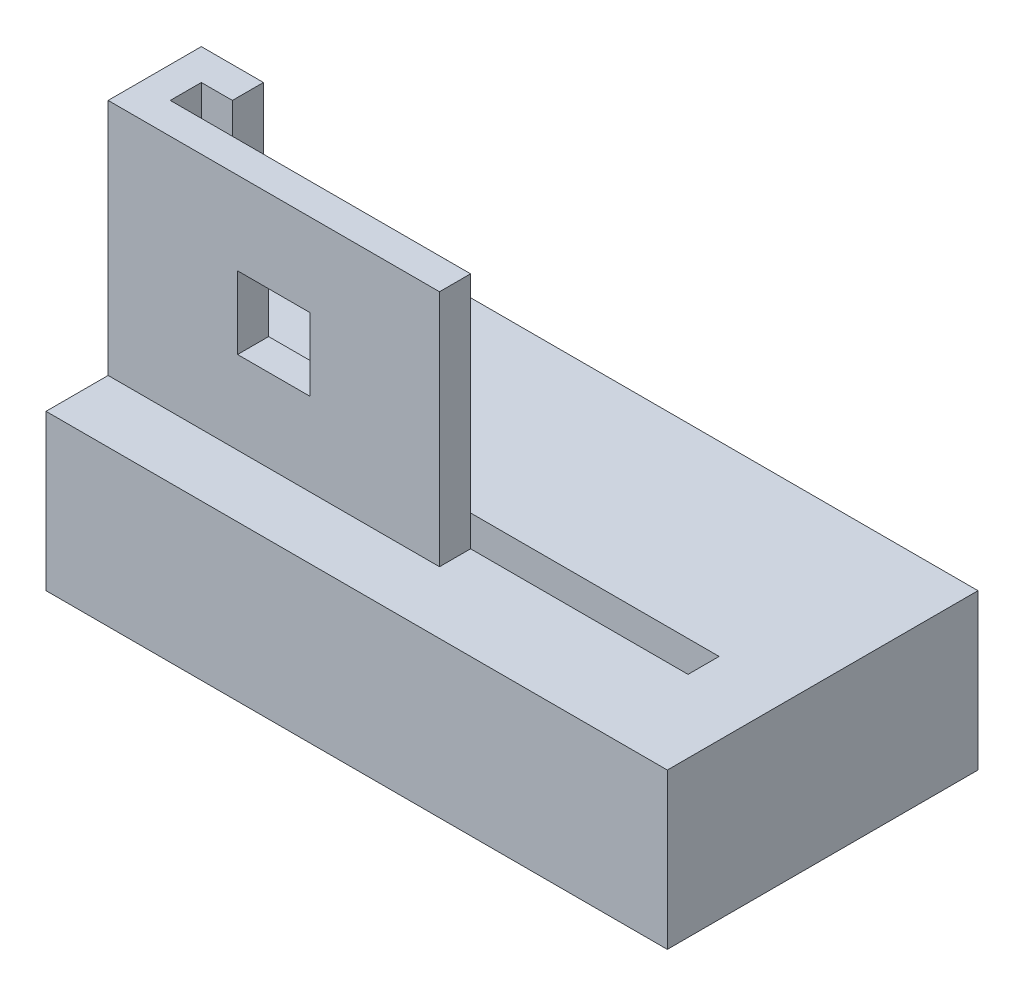
ISO-10303-21;
HEADER;
FILE_DESCRIPTION(('STEP AP214'),'2;1');
FILE_NAME('part.step','',(''),(''),'','','');
FILE_SCHEMA(('AUTOMOTIVE_DESIGN { 1 0 10303 214 1 1 1 1 }'));
ENDSEC;
DATA;
#1=APPLICATION_CONTEXT('core data for automotive mechanical design processes');
#2=APPLICATION_PROTOCOL_DEFINITION('international standard','automotive_design',2000,#1);
#3=PRODUCT_CONTEXT('',#1,'mechanical');
#4=PRODUCT('Part','Part','',(#3));
#5=PRODUCT_RELATED_PRODUCT_CATEGORY('part','',(#4));
#6=PRODUCT_DEFINITION_FORMATION('','',#4);
#7=PRODUCT_DEFINITION_CONTEXT('part definition',#1,'design');
#8=PRODUCT_DEFINITION('design','',#6,#7);
#9=PRODUCT_DEFINITION_SHAPE('','',#8);
#10=(LENGTH_UNIT() NAMED_UNIT(*) SI_UNIT(.MILLI.,.METRE.));
#11=(NAMED_UNIT(*) PLANE_ANGLE_UNIT() SI_UNIT($,.RADIAN.));
#12=(NAMED_UNIT(*) SI_UNIT($,.STERADIAN.) SOLID_ANGLE_UNIT());
#13=UNCERTAINTY_MEASURE_WITH_UNIT(LENGTH_MEASURE(1.E-05),#10,'distance_accuracy_value','');
#14=(GEOMETRIC_REPRESENTATION_CONTEXT(3) GLOBAL_UNCERTAINTY_ASSIGNED_CONTEXT((#13)) GLOBAL_UNIT_ASSIGNED_CONTEXT((#10,
#11,#12)) REPRESENTATION_CONTEXT('',''));
#15=CARTESIAN_POINT('',(0.,0.,0.));
#16=DIRECTION('',(0.,0.,1.));
#17=DIRECTION('',(1.,0.,0.));
#18=AXIS2_PLACEMENT_3D('',#15,#16,#17);
#19=CARTESIAN_POINT('',(0.,15.,0.));
#20=DIRECTION('',(0.,-1.,0.));
#21=DIRECTION('',(0.,0.,-1.));
#22=AXIS2_PLACEMENT_3D('',#19,#20,#21);
#23=PLANE('',#22);
#24=DIRECTION('',(0.,0.,-1.));
#25=VECTOR('',#24,1.);
#26=CARTESIAN_POINT('',(-54.,15.,15.));
#27=LINE('',#26,#25);
#28=CARTESIAN_POINT('',(-54.,15.,18.));
#29=VERTEX_POINT('',#28);
#30=CARTESIAN_POINT('',(-54.,15.,15.));
#31=VERTEX_POINT('',#30);
#32=EDGE_CURVE('E236',#29,#31,#27,.T.);
#33=ORIENTED_EDGE('',*,*,#32,.F.);
#34=DIRECTION('',(-1.,0.,0.));
#35=VECTOR('',#34,1.);
#36=CARTESIAN_POINT('',(-57.,15.,18.));
#37=LINE('',#36,#35);
#38=CARTESIAN_POINT('',(-6.99999999999999,15.,18.));
#39=VERTEX_POINT('',#38);
#40=EDGE_CURVE('E194',#39,#29,#37,.T.);
#41=ORIENTED_EDGE('',*,*,#40,.F.);
#42=DIRECTION('',(0.,0.,-1.));
#43=VECTOR('',#42,1.);
#44=CARTESIAN_POINT('',(-6.99999999999999,15.,18.));
#45=LINE('',#44,#43);
#46=CARTESIAN_POINT('',(-6.99999999999999,15.,21.));
#47=VERTEX_POINT('',#46);
#48=EDGE_CURVE('E205',#47,#39,#45,.T.);
#49=ORIENTED_EDGE('',*,*,#48,.F.);
#50=DIRECTION('',(1.,0.,0.));
#51=VECTOR('',#50,1.);
#52=CARTESIAN_POINT('',(-57.,15.,21.));
#53=LINE('',#52,#51);
#54=CARTESIAN_POINT('',(-28.,15.,21.));
#55=VERTEX_POINT('',#54);
#56=EDGE_CURVE('E187',#55,#47,#53,.T.);
#57=ORIENTED_EDGE('',*,*,#56,.F.);
#58=DIRECTION('',(0.,0.,-1.));
#59=VECTOR('',#58,1.);
#60=CARTESIAN_POINT('',(-28.,15.,21.));
#61=LINE('',#60,#59);
#62=CARTESIAN_POINT('',(-28.,15.,24.));
#63=VERTEX_POINT('',#62);
#64=EDGE_CURVE('E233',#63,#55,#61,.T.);
#65=ORIENTED_EDGE('',*,*,#64,.F.);
#66=DIRECTION('',(1.,0.,0.));
#67=VECTOR('',#66,1.);
#68=CARTESIAN_POINT('',(-28.,15.,24.));
#69=LINE('',#68,#67);
#70=CARTESIAN_POINT('',(-60.,15.,24.));
#71=VERTEX_POINT('',#70);
#72=EDGE_CURVE('E211',#71,#63,#69,.T.);
#73=ORIENTED_EDGE('',*,*,#72,.F.);
#74=DIRECTION('',(0.,0.,1.));
#75=VECTOR('',#74,1.);
#76=CARTESIAN_POINT('',(-60.,15.,0.));
#77=LINE('',#76,#75);
#78=CARTESIAN_POINT('',(-60.,15.,30.));
#79=VERTEX_POINT('',#78);
#80=EDGE_CURVE('E346',#71,#79,#77,.T.);
#81=ORIENTED_EDGE('',*,*,#80,.T.);
#82=DIRECTION('',(-1.,0.,0.));
#83=VECTOR('',#82,1.);
#84=CARTESIAN_POINT('',(0.,15.,30.));
#85=LINE('',#84,#83);
#86=CARTESIAN_POINT('',(0.,15.,30.));
#87=VERTEX_POINT('',#86);
#88=EDGE_CURVE('E350',#87,#79,#85,.T.);
#89=ORIENTED_EDGE('',*,*,#88,.F.);
#90=DIRECTION('',(0.,0.,1.));
#91=VECTOR('',#90,1.);
#92=CARTESIAN_POINT('',(0.,15.,0.));
#93=LINE('',#92,#91);
#94=CARTESIAN_POINT('',(0.,15.,0.));
#95=VERTEX_POINT('',#94);
#96=EDGE_CURVE('E337',#95,#87,#93,.T.);
#97=ORIENTED_EDGE('',*,*,#96,.F.);
#98=DIRECTION('',(-1.,0.,0.));
#99=VECTOR('',#98,1.);
#100=CARTESIAN_POINT('',(0.,15.,0.));
#101=LINE('',#100,#99);
#102=CARTESIAN_POINT('',(-60.,15.,0.));
#103=VERTEX_POINT('',#102);
#104=EDGE_CURVE('E331',#95,#103,#101,.T.);
#105=ORIENTED_EDGE('',*,*,#104,.T.);
#106=CARTESIAN_POINT('',(-60.,15.,15.));
#107=VERTEX_POINT('',#106);
#108=EDGE_CURVE('E344',#103,#107,#77,.T.);
#109=ORIENTED_EDGE('',*,*,#108,.T.);
#110=DIRECTION('',(-1.,0.,0.));
#111=VECTOR('',#110,1.);
#112=CARTESIAN_POINT('',(-60.,15.,15.));
#113=LINE('',#112,#111);
#114=EDGE_CURVE('E218',#31,#107,#113,.T.);
#115=ORIENTED_EDGE('',*,*,#114,.F.);
#116=EDGE_LOOP('',(#33,#41,#49,#57,#65,#73,#81,#89,#97,#105,#109,#115));
#117=FACE_BOUND('',#116,.T.);
#118=ADVANCED_FACE('F33',(#117),#23,.F.);
#119=CARTESIAN_POINT('',(0.,0.,0.));
#120=DIRECTION('',(0.,-1.,0.));
#121=DIRECTION('',(0.,0.,-1.));
#122=AXIS2_PLACEMENT_3D('',#119,#120,#121);
#123=PLANE('',#122);
#124=DIRECTION('',(0.,0.,1.));
#125=VECTOR('',#124,1.);
#126=CARTESIAN_POINT('',(-60.,0.,0.));
#127=LINE('',#126,#125);
#128=CARTESIAN_POINT('',(-60.,0.,15.));
#129=VERTEX_POINT('',#128);
#130=CARTESIAN_POINT('',(-60.,0.,30.));
#131=VERTEX_POINT('',#130);
#132=EDGE_CURVE('E316',#129,#131,#127,.T.);
#133=ORIENTED_EDGE('',*,*,#132,.F.);
#134=CARTESIAN_POINT('',(-55.,0.,15.));
#135=DIRECTION('',(0.,-1.,0.));
#136=DIRECTION('',(0.,0.,-1.));
#137=AXIS2_PLACEMENT_3D('',#134,#135,#136);
#138=CIRCLE('',#137,5.);
#139=EDGE_CURVE('E328',#129,#129,#138,.T.);
#140=ORIENTED_EDGE('',*,*,#139,.F.);
#141=CARTESIAN_POINT('',(-60.,0.,0.));
#142=VERTEX_POINT('',#141);
#143=EDGE_CURVE('E334',#142,#129,#127,.T.);
#144=ORIENTED_EDGE('',*,*,#143,.F.);
#145=DIRECTION('',(-1.,0.,0.));
#146=VECTOR('',#145,1.);
#147=CARTESIAN_POINT('',(0.,0.,0.));
#148=LINE('',#147,#146);
#149=CARTESIAN_POINT('',(0.,0.,0.));
#150=VERTEX_POINT('',#149);
#151=EDGE_CURVE('E323',#150,#142,#148,.T.);
#152=ORIENTED_EDGE('',*,*,#151,.F.);
#153=DIRECTION('',(0.,0.,1.));
#154=VECTOR('',#153,1.);
#155=CARTESIAN_POINT('',(0.,0.,0.));
#156=LINE('',#155,#154);
#157=CARTESIAN_POINT('',(0.,0.,30.));
#158=VERTEX_POINT('',#157);
#159=EDGE_CURVE('E317',#150,#158,#156,.T.);
#160=ORIENTED_EDGE('',*,*,#159,.T.);
#161=DIRECTION('',(-1.,0.,0.));
#162=VECTOR('',#161,1.);
#163=CARTESIAN_POINT('',(0.,0.,30.));
#164=LINE('',#163,#162);
#165=EDGE_CURVE('E308',#158,#131,#164,.T.);
#166=ORIENTED_EDGE('',*,*,#165,.T.);
#167=EDGE_LOOP('',(#133,#140,#144,#152,#160,#166));
#168=FACE_BOUND('',#167,.T.);
#169=CARTESIAN_POINT('',(-15.,0.,15.));
#170=DIRECTION('',(0.,-1.,0.));
#171=DIRECTION('',(0.,0.,-1.));
#172=AXIS2_PLACEMENT_3D('',#169,#170,#171);
#173=CIRCLE('',#172,5.);
#174=CARTESIAN_POINT('',(-15.,0.,10.));
#175=VERTEX_POINT('',#174);
#176=EDGE_CURVE('E358',#175,#175,#173,.T.);
#177=ORIENTED_EDGE('',*,*,#176,.F.);
#178=EDGE_LOOP('',(#177));
#179=FACE_BOUND('',#178,.T.);
#180=ADVANCED_FACE('F277',(#168,#179),#123,.T.);
#181=CARTESIAN_POINT('',(0.,15.,0.));
#182=DIRECTION('',(1.,0.,0.));
#183=DIRECTION('',(0.,0.,-1.));
#184=AXIS2_PLACEMENT_3D('',#181,#182,#183);
#185=PLANE('',#184);
#186=ORIENTED_EDGE('',*,*,#159,.F.);
#187=DIRECTION('',(0.,-1.,0.));
#188=VECTOR('',#187,1.);
#189=CARTESIAN_POINT('',(0.,15.,0.));
#190=LINE('',#189,#188);
#191=EDGE_CURVE('E255',#95,#150,#190,.T.);
#192=ORIENTED_EDGE('',*,*,#191,.F.);
#193=ORIENTED_EDGE('',*,*,#96,.T.);
#194=DIRECTION('',(0.,-1.,0.));
#195=VECTOR('',#194,1.);
#196=CARTESIAN_POINT('',(0.,15.,30.));
#197=LINE('',#196,#195);
#198=EDGE_CURVE('E311',#87,#158,#197,.T.);
#199=ORIENTED_EDGE('',*,*,#198,.T.);
#200=EDGE_LOOP('',(#186,#192,#193,#199));
#201=FACE_BOUND('',#200,.T.);
#202=ADVANCED_FACE('F35',(#201),#185,.T.);
#203=CARTESIAN_POINT('',(0.,15.,0.));
#204=DIRECTION('',(0.,0.,1.));
#205=DIRECTION('',(1.,0.,0.));
#206=AXIS2_PLACEMENT_3D('',#203,#204,#205);
#207=PLANE('',#206);
#208=ORIENTED_EDGE('',*,*,#151,.T.);
#209=DIRECTION('',(0.,-1.,0.));
#210=VECTOR('',#209,1.);
#211=CARTESIAN_POINT('',(-60.,15.,0.));
#212=LINE('',#211,#210);
#213=EDGE_CURVE('E339',#103,#142,#212,.T.);
#214=ORIENTED_EDGE('',*,*,#213,.F.);
#215=ORIENTED_EDGE('',*,*,#104,.F.);
#216=ORIENTED_EDGE('',*,*,#191,.T.);
#217=EDGE_LOOP('',(#208,#214,#215,#216));
#218=FACE_BOUND('',#217,.T.);
#219=ADVANCED_FACE('F290',(#218),#207,.F.);
#220=CARTESIAN_POINT('',(-60.,15.,0.));
#221=DIRECTION('',(1.,0.,0.));
#222=DIRECTION('',(0.,0.,-1.));
#223=AXIS2_PLACEMENT_3D('',#220,#221,#222);
#224=PLANE('',#223);
#225=ORIENTED_EDGE('',*,*,#143,.T.);
#226=ORIENTED_EDGE('',*,*,#132,.T.);
#227=DIRECTION('',(0.,-1.,0.));
#228=VECTOR('',#227,1.);
#229=CARTESIAN_POINT('',(-60.,15.,30.));
#230=LINE('',#229,#228);
#231=EDGE_CURVE('E314',#79,#131,#230,.T.);
#232=ORIENTED_EDGE('',*,*,#231,.F.);
#233=ORIENTED_EDGE('',*,*,#80,.F.);
#234=DIRECTION('',(0.,-1.,0.));
#235=VECTOR('',#234,1.);
#236=CARTESIAN_POINT('',(-60.,38.,24.));
#237=LINE('',#236,#235);
#238=CARTESIAN_POINT('',(-60.,38.,24.));
#239=VERTEX_POINT('',#238);
#240=EDGE_CURVE('E361',#239,#71,#237,.T.);
#241=ORIENTED_EDGE('',*,*,#240,.F.);
#242=DIRECTION('',(0.,0.,1.));
#243=VECTOR('',#242,1.);
#244=CARTESIAN_POINT('',(-60.,38.,15.));
#245=LINE('',#244,#243);
#246=CARTESIAN_POINT('',(-60.,38.,15.));
#247=VERTEX_POINT('',#246);
#248=EDGE_CURVE('E214',#247,#239,#245,.T.);
#249=ORIENTED_EDGE('',*,*,#248,.F.);
#250=DIRECTION('',(0.,-1.,0.));
#251=VECTOR('',#250,1.);
#252=CARTESIAN_POINT('',(-60.,38.,15.));
#253=LINE('',#252,#251);
#254=EDGE_CURVE('E232',#247,#107,#253,.T.);
#255=ORIENTED_EDGE('',*,*,#254,.T.);
#256=ORIENTED_EDGE('',*,*,#108,.F.);
#257=ORIENTED_EDGE('',*,*,#213,.T.);
#258=EDGE_LOOP('',(#225,#226,#232,#233,#241,#249,#255,#256,#257));
#259=FACE_BOUND('',#258,.T.);
#260=ADVANCED_FACE('F293',(#259),#224,.F.);
#261=CARTESIAN_POINT('',(0.,15.,30.));
#262=DIRECTION('',(0.,0.,1.));
#263=DIRECTION('',(1.,0.,0.));
#264=AXIS2_PLACEMENT_3D('',#261,#262,#263);
#265=PLANE('',#264);
#266=ORIENTED_EDGE('',*,*,#165,.F.);
#267=ORIENTED_EDGE('',*,*,#198,.F.);
#268=ORIENTED_EDGE('',*,*,#88,.T.);
#269=ORIENTED_EDGE('',*,*,#231,.T.);
#270=EDGE_LOOP('',(#266,#267,#268,#269));
#271=FACE_BOUND('',#270,.T.);
#272=ADVANCED_FACE('F296',(#271),#265,.T.);
#273=CARTESIAN_POINT('',(-55.,-6.,15.));
#274=DIRECTION('',(0.,1.,0.));
#275=DIRECTION('',(0.,0.,1.));
#276=AXIS2_PLACEMENT_3D('',#273,#274,#275);
#277=CYLINDRICAL_SURFACE('',#276,5.);
#278=CARTESIAN_POINT('',(-55.,-6.,15.));
#279=DIRECTION('',(0.,-1.,0.));
#280=DIRECTION('',(0.,0.,-1.));
#281=AXIS2_PLACEMENT_3D('',#278,#279,#280);
#282=CIRCLE('',#281,5.);
#283=CARTESIAN_POINT('',(-55.,-6.,9.99999999999999));
#284=VERTEX_POINT('',#283);
#285=EDGE_CURVE('E325',#284,#284,#282,.T.);
#286=ORIENTED_EDGE('',*,*,#285,.F.);
#287=EDGE_LOOP('',(#286));
#288=FACE_BOUND('',#287,.T.);
#289=ORIENTED_EDGE('',*,*,#139,.T.);
#290=EDGE_LOOP('',(#289));
#291=FACE_BOUND('',#290,.T.);
#292=ADVANCED_FACE('F287',(#288,#291),#277,.T.);
#293=CARTESIAN_POINT('',(-55.,-6.,15.));
#294=DIRECTION('',(0.,-1.,0.));
#295=DIRECTION('',(0.,0.,-1.));
#296=AXIS2_PLACEMENT_3D('',#293,#294,#295);
#297=PLANE('',#296);
#298=ORIENTED_EDGE('',*,*,#285,.T.);
#299=EDGE_LOOP('',(#298));
#300=FACE_BOUND('',#299,.T.);
#301=ADVANCED_FACE('F303',(#300),#297,.T.);
#302=CARTESIAN_POINT('',(-15.,-6.,15.));
#303=DIRECTION('',(0.,1.,0.));
#304=DIRECTION('',(0.,0.,1.));
#305=AXIS2_PLACEMENT_3D('',#302,#303,#304);
#306=CYLINDRICAL_SURFACE('',#305,5.);
#307=CARTESIAN_POINT('',(-15.,-6.,15.));
#308=DIRECTION('',(0.,-1.,0.));
#309=DIRECTION('',(0.,0.,-1.));
#310=AXIS2_PLACEMENT_3D('',#307,#308,#309);
#311=CIRCLE('',#310,5.);
#312=CARTESIAN_POINT('',(-15.,-6.,10.));
#313=VERTEX_POINT('',#312);
#314=EDGE_CURVE('E356',#313,#313,#311,.T.);
#315=ORIENTED_EDGE('',*,*,#314,.F.);
#316=EDGE_LOOP('',(#315));
#317=FACE_BOUND('',#316,.T.);
#318=ORIENTED_EDGE('',*,*,#176,.T.);
#319=EDGE_LOOP('',(#318));
#320=FACE_BOUND('',#319,.T.);
#321=ADVANCED_FACE('F434',(#317,#320),#306,.T.);
#322=CARTESIAN_POINT('',(-15.,-6.,15.));
#323=DIRECTION('',(0.,-1.,0.));
#324=DIRECTION('',(0.,0.,-1.));
#325=AXIS2_PLACEMENT_3D('',#322,#323,#324);
#326=PLANE('',#325);
#327=ORIENTED_EDGE('',*,*,#314,.T.);
#328=EDGE_LOOP('',(#327));
#329=FACE_BOUND('',#328,.T.);
#330=ADVANCED_FACE('F431',(#329),#326,.T.);
#331=CARTESIAN_POINT('',(-28.,38.,24.));
#332=DIRECTION('',(0.,0.,-1.));
#333=DIRECTION('',(-1.,0.,0.));
#334=AXIS2_PLACEMENT_3D('',#331,#332,#333);
#335=PLANE('',#334);
#336=DIRECTION('',(-1.,0.,0.));
#337=VECTOR('',#336,1.);
#338=CARTESIAN_POINT('',(-47.5,30.,24.));
#339=LINE('',#338,#337);
#340=CARTESIAN_POINT('',(-40.5,30.,24.));
#341=VERTEX_POINT('',#340);
#342=CARTESIAN_POINT('',(-47.5,30.,24.));
#343=VERTEX_POINT('',#342);
#344=EDGE_CURVE('E173',#341,#343,#339,.T.);
#345=ORIENTED_EDGE('',*,*,#344,.F.);
#346=DIRECTION('',(0.,1.,0.));
#347=VECTOR('',#346,1.);
#348=CARTESIAN_POINT('',(-40.5,23.,24.));
#349=LINE('',#348,#347);
#350=CARTESIAN_POINT('',(-40.5,23.,24.));
#351=VERTEX_POINT('',#350);
#352=EDGE_CURVE('E48',#351,#341,#349,.T.);
#353=ORIENTED_EDGE('',*,*,#352,.F.);
#354=DIRECTION('',(1.,0.,0.));
#355=VECTOR('',#354,1.);
#356=CARTESIAN_POINT('',(-47.5,23.,24.));
#357=LINE('',#356,#355);
#358=CARTESIAN_POINT('',(-47.5,23.,24.));
#359=VERTEX_POINT('',#358);
#360=EDGE_CURVE('E180',#359,#351,#357,.T.);
#361=ORIENTED_EDGE('',*,*,#360,.F.);
#362=DIRECTION('',(0.,-1.,0.));
#363=VECTOR('',#362,1.);
#364=CARTESIAN_POINT('',(-47.5,23.,24.));
#365=LINE('',#364,#363);
#366=EDGE_CURVE('E164',#343,#359,#365,.T.);
#367=ORIENTED_EDGE('',*,*,#366,.F.);
#368=EDGE_LOOP('',(#345,#353,#361,#367));
#369=FACE_BOUND('',#368,.T.);
#370=ORIENTED_EDGE('',*,*,#72,.T.);
#371=DIRECTION('',(0.,-1.,0.));
#372=VECTOR('',#371,1.);
#373=CARTESIAN_POINT('',(-28.,38.,24.));
#374=LINE('',#373,#372);
#375=CARTESIAN_POINT('',(-28.,38.,24.));
#376=VERTEX_POINT('',#375);
#377=EDGE_CURVE('E364',#376,#63,#374,.T.);
#378=ORIENTED_EDGE('',*,*,#377,.F.);
#379=DIRECTION('',(1.,0.,0.));
#380=VECTOR('',#379,1.);
#381=CARTESIAN_POINT('',(-28.,38.,24.));
#382=LINE('',#381,#380);
#383=EDGE_CURVE('E217',#239,#376,#382,.T.);
#384=ORIENTED_EDGE('',*,*,#383,.F.);
#385=ORIENTED_EDGE('',*,*,#240,.T.);
#386=EDGE_LOOP('',(#370,#378,#384,#385));
#387=FACE_BOUND('',#386,.T.);
#388=ADVANCED_FACE('F177',(#369,#387),#335,.F.);
#389=CARTESIAN_POINT('',(-28.,38.,21.));
#390=DIRECTION('',(-1.,0.,0.));
#391=DIRECTION('',(0.,0.,1.));
#392=AXIS2_PLACEMENT_3D('',#389,#390,#391);
#393=PLANE('',#392);
#394=ORIENTED_EDGE('',*,*,#64,.T.);
#395=DIRECTION('',(0.,-1.,0.));
#396=VECTOR('',#395,1.);
#397=CARTESIAN_POINT('',(-28.,38.,21.));
#398=LINE('',#397,#396);
#399=CARTESIAN_POINT('',(-28.,38.,21.));
#400=VERTEX_POINT('',#399);
#401=EDGE_CURVE('E367',#400,#55,#398,.T.);
#402=ORIENTED_EDGE('',*,*,#401,.F.);
#403=DIRECTION('',(0.,0.,-1.));
#404=VECTOR('',#403,1.);
#405=CARTESIAN_POINT('',(-28.,38.,21.));
#406=LINE('',#405,#404);
#407=EDGE_CURVE('E220',#376,#400,#406,.T.);
#408=ORIENTED_EDGE('',*,*,#407,.F.);
#409=ORIENTED_EDGE('',*,*,#377,.T.);
#410=EDGE_LOOP('',(#394,#402,#408,#409));
#411=FACE_BOUND('',#410,.T.);
#412=ADVANCED_FACE('F409',(#411),#393,.F.);
#413=CARTESIAN_POINT('',(-57.,38.,21.));
#414=DIRECTION('',(0.,0.,1.));
#415=DIRECTION('',(1.,0.,0.));
#416=AXIS2_PLACEMENT_3D('',#413,#414,#415);
#417=PLANE('',#416);
#418=DIRECTION('',(1.,0.,0.));
#419=VECTOR('',#418,1.);
#420=CARTESIAN_POINT('',(-57.,23.,21.));
#421=LINE('',#420,#419);
#422=CARTESIAN_POINT('',(-47.5,23.,21.));
#423=VERTEX_POINT('',#422);
#424=CARTESIAN_POINT('',(-40.5,23.,21.));
#425=VERTEX_POINT('',#424);
#426=EDGE_CURVE('E41',#423,#425,#421,.T.);
#427=ORIENTED_EDGE('',*,*,#426,.T.);
#428=DIRECTION('',(0.,1.,0.));
#429=VECTOR('',#428,1.);
#430=CARTESIAN_POINT('',(-40.5,38.,21.));
#431=LINE('',#430,#429);
#432=CARTESIAN_POINT('',(-40.5,30.,21.));
#433=VERTEX_POINT('',#432);
#434=EDGE_CURVE('E11',#425,#433,#431,.T.);
#435=ORIENTED_EDGE('',*,*,#434,.T.);
#436=DIRECTION('',(-1.,0.,0.));
#437=VECTOR('',#436,1.);
#438=CARTESIAN_POINT('',(-57.,30.,21.));
#439=LINE('',#438,#437);
#440=CARTESIAN_POINT('',(-47.5,30.,21.));
#441=VERTEX_POINT('',#440);
#442=EDGE_CURVE('E253',#433,#441,#439,.T.);
#443=ORIENTED_EDGE('',*,*,#442,.T.);
#444=DIRECTION('',(0.,-1.,0.));
#445=VECTOR('',#444,1.);
#446=CARTESIAN_POINT('',(-47.5,38.,21.));
#447=LINE('',#446,#445);
#448=EDGE_CURVE('E167',#441,#423,#447,.T.);
#449=ORIENTED_EDGE('',*,*,#448,.T.);
#450=EDGE_LOOP('',(#427,#435,#443,#449));
#451=FACE_BOUND('',#450,.T.);
#452=ORIENTED_EDGE('',*,*,#401,.T.);
#453=ORIENTED_EDGE('',*,*,#56,.T.);
#454=DIRECTION('',(0.,1.,0.));
#455=VECTOR('',#454,1.);
#456=CARTESIAN_POINT('',(-6.99999999999999,8.,21.));
#457=LINE('',#456,#455);
#458=CARTESIAN_POINT('',(-6.99999999999999,8.,21.));
#459=VERTEX_POINT('',#458);
#460=EDGE_CURVE('E203',#459,#47,#457,.T.);
#461=ORIENTED_EDGE('',*,*,#460,.F.);
#462=DIRECTION('',(1.,0.,0.));
#463=VECTOR('',#462,1.);
#464=CARTESIAN_POINT('',(-57.,8.,21.));
#465=LINE('',#464,#463);
#466=CARTESIAN_POINT('',(-57.,8.,21.));
#467=VERTEX_POINT('',#466);
#468=EDGE_CURVE('E193',#467,#459,#465,.T.);
#469=ORIENTED_EDGE('',*,*,#468,.F.);
#470=DIRECTION('',(0.,-1.,0.));
#471=VECTOR('',#470,1.);
#472=CARTESIAN_POINT('',(-57.,38.,21.));
#473=LINE('',#472,#471);
#474=CARTESIAN_POINT('',(-57.,38.,21.));
#475=VERTEX_POINT('',#474);
#476=EDGE_CURVE('E370',#475,#467,#473,.T.);
#477=ORIENTED_EDGE('',*,*,#476,.F.);
#478=DIRECTION('',(-1.,0.,0.));
#479=VECTOR('',#478,1.);
#480=CARTESIAN_POINT('',(-57.,38.,21.));
#481=LINE('',#480,#479);
#482=EDGE_CURVE('E222',#400,#475,#481,.T.);
#483=ORIENTED_EDGE('',*,*,#482,.F.);
#484=EDGE_LOOP('',(#452,#453,#461,#469,#477,#483));
#485=FACE_BOUND('',#484,.T.);
#486=ADVANCED_FACE('F258',(#451,#485),#417,.F.);
#487=CARTESIAN_POINT('',(-57.,38.,18.));
#488=DIRECTION('',(-1.,0.,0.));
#489=DIRECTION('',(0.,0.,1.));
#490=AXIS2_PLACEMENT_3D('',#487,#488,#489);
#491=PLANE('',#490);
#492=ORIENTED_EDGE('',*,*,#476,.T.);
#493=DIRECTION('',(0.,0.,1.));
#494=VECTOR('',#493,1.);
#495=CARTESIAN_POINT('',(-57.,8.,18.));
#496=LINE('',#495,#494);
#497=CARTESIAN_POINT('',(-57.,8.,18.));
#498=VERTEX_POINT('',#497);
#499=EDGE_CURVE('E190',#498,#467,#496,.T.);
#500=ORIENTED_EDGE('',*,*,#499,.F.);
#501=DIRECTION('',(0.,-1.,0.));
#502=VECTOR('',#501,1.);
#503=CARTESIAN_POINT('',(-57.,38.,18.));
#504=LINE('',#503,#502);
#505=CARTESIAN_POINT('',(-57.,38.,18.));
#506=VERTEX_POINT('',#505);
#507=EDGE_CURVE('E372',#506,#498,#504,.T.);
#508=ORIENTED_EDGE('',*,*,#507,.F.);
#509=DIRECTION('',(0.,0.,-1.));
#510=VECTOR('',#509,1.);
#511=CARTESIAN_POINT('',(-57.,38.,18.));
#512=LINE('',#511,#510);
#513=EDGE_CURVE('E224',#475,#506,#512,.T.);
#514=ORIENTED_EDGE('',*,*,#513,.F.);
#515=EDGE_LOOP('',(#492,#500,#508,#514));
#516=FACE_BOUND('',#515,.T.);
#517=ADVANCED_FACE('F416',(#516),#491,.F.);
#518=CARTESIAN_POINT('',(-54.,38.,18.));
#519=DIRECTION('',(0.,0.,-1.));
#520=DIRECTION('',(-1.,0.,0.));
#521=AXIS2_PLACEMENT_3D('',#518,#519,#520);
#522=PLANE('',#521);
#523=ORIENTED_EDGE('',*,*,#507,.T.);
#524=DIRECTION('',(-1.,0.,0.));
#525=VECTOR('',#524,1.);
#526=CARTESIAN_POINT('',(-57.,8.,18.));
#527=LINE('',#526,#525);
#528=CARTESIAN_POINT('',(-6.99999999999999,8.,18.));
#529=VERTEX_POINT('',#528);
#530=EDGE_CURVE('E200',#529,#498,#527,.T.);
#531=ORIENTED_EDGE('',*,*,#530,.F.);
#532=DIRECTION('',(0.,1.,0.));
#533=VECTOR('',#532,1.);
#534=CARTESIAN_POINT('',(-6.99999999999999,8.,18.));
#535=LINE('',#534,#533);
#536=EDGE_CURVE('E209',#529,#39,#535,.T.);
#537=ORIENTED_EDGE('',*,*,#536,.T.);
#538=ORIENTED_EDGE('',*,*,#40,.T.);
#539=DIRECTION('',(0.,-1.,0.));
#540=VECTOR('',#539,1.);
#541=CARTESIAN_POINT('',(-54.,38.,18.));
#542=LINE('',#541,#540);
#543=CARTESIAN_POINT('',(-54.,38.,18.));
#544=VERTEX_POINT('',#543);
#545=EDGE_CURVE('E373',#544,#29,#542,.T.);
#546=ORIENTED_EDGE('',*,*,#545,.F.);
#547=DIRECTION('',(1.,0.,0.));
#548=VECTOR('',#547,1.);
#549=CARTESIAN_POINT('',(-54.,38.,18.));
#550=LINE('',#549,#548);
#551=EDGE_CURVE('E226',#506,#544,#550,.T.);
#552=ORIENTED_EDGE('',*,*,#551,.F.);
#553=EDGE_LOOP('',(#523,#531,#537,#538,#546,#552));
#554=FACE_BOUND('',#553,.T.);
#555=ADVANCED_FACE('F402',(#554),#522,.F.);
#556=CARTESIAN_POINT('',(-54.,38.,15.));
#557=DIRECTION('',(-1.,0.,0.));
#558=DIRECTION('',(0.,0.,1.));
#559=AXIS2_PLACEMENT_3D('',#556,#557,#558);
#560=PLANE('',#559);
#561=ORIENTED_EDGE('',*,*,#32,.T.);
#562=DIRECTION('',(0.,-1.,0.));
#563=VECTOR('',#562,1.);
#564=CARTESIAN_POINT('',(-54.,38.,15.));
#565=LINE('',#564,#563);
#566=CARTESIAN_POINT('',(-54.,38.,15.));
#567=VERTEX_POINT('',#566);
#568=EDGE_CURVE('E241',#567,#31,#565,.T.);
#569=ORIENTED_EDGE('',*,*,#568,.F.);
#570=DIRECTION('',(0.,0.,-1.));
#571=VECTOR('',#570,1.);
#572=CARTESIAN_POINT('',(-54.,38.,15.));
#573=LINE('',#572,#571);
#574=EDGE_CURVE('E228',#544,#567,#573,.T.);
#575=ORIENTED_EDGE('',*,*,#574,.F.);
#576=ORIENTED_EDGE('',*,*,#545,.T.);
#577=EDGE_LOOP('',(#561,#569,#575,#576));
#578=FACE_BOUND('',#577,.T.);
#579=ADVANCED_FACE('F384',(#578),#560,.F.);
#580=CARTESIAN_POINT('',(-60.,38.,15.));
#581=DIRECTION('',(0.,0.,1.));
#582=DIRECTION('',(1.,0.,0.));
#583=AXIS2_PLACEMENT_3D('',#580,#581,#582);
#584=PLANE('',#583);
#585=ORIENTED_EDGE('',*,*,#114,.T.);
#586=ORIENTED_EDGE('',*,*,#254,.F.);
#587=DIRECTION('',(-1.,0.,0.));
#588=VECTOR('',#587,1.);
#589=CARTESIAN_POINT('',(-60.,38.,15.));
#590=LINE('',#589,#588);
#591=EDGE_CURVE('E230',#567,#247,#590,.T.);
#592=ORIENTED_EDGE('',*,*,#591,.F.);
#593=ORIENTED_EDGE('',*,*,#568,.T.);
#594=EDGE_LOOP('',(#585,#586,#592,#593));
#595=FACE_BOUND('',#594,.T.);
#596=ADVANCED_FACE('F382',(#595),#584,.F.);
#597=CARTESIAN_POINT('',(0.,38.,0.));
#598=DIRECTION('',(0.,-1.,0.));
#599=DIRECTION('',(0.,0.,-1.));
#600=AXIS2_PLACEMENT_3D('',#597,#598,#599);
#601=PLANE('',#600);
#602=ORIENTED_EDGE('',*,*,#248,.T.);
#603=ORIENTED_EDGE('',*,*,#383,.T.);
#604=ORIENTED_EDGE('',*,*,#407,.T.);
#605=ORIENTED_EDGE('',*,*,#482,.T.);
#606=ORIENTED_EDGE('',*,*,#513,.T.);
#607=ORIENTED_EDGE('',*,*,#551,.T.);
#608=ORIENTED_EDGE('',*,*,#574,.T.);
#609=ORIENTED_EDGE('',*,*,#591,.T.);
#610=EDGE_LOOP('',(#602,#603,#604,#605,#606,#607,#608,#609));
#611=FACE_BOUND('',#610,.T.);
#612=ADVANCED_FACE('F396',(#611),#601,.F.);
#613=CARTESIAN_POINT('',(-6.99999999999999,8.,18.));
#614=DIRECTION('',(1.,0.,0.));
#615=DIRECTION('',(0.,0.,-1.));
#616=AXIS2_PLACEMENT_3D('',#613,#614,#615);
#617=PLANE('',#616);
#618=ORIENTED_EDGE('',*,*,#48,.T.);
#619=ORIENTED_EDGE('',*,*,#536,.F.);
#620=DIRECTION('',(0.,0.,-1.));
#621=VECTOR('',#620,1.);
#622=CARTESIAN_POINT('',(-6.99999999999999,8.,18.));
#623=LINE('',#622,#621);
#624=EDGE_CURVE('E197',#459,#529,#623,.T.);
#625=ORIENTED_EDGE('',*,*,#624,.F.);
#626=ORIENTED_EDGE('',*,*,#460,.T.);
#627=EDGE_LOOP('',(#618,#619,#625,#626));
#628=FACE_BOUND('',#627,.T.);
#629=ADVANCED_FACE('F272',(#628),#617,.F.);
#630=CARTESIAN_POINT('',(0.,8.,0.));
#631=DIRECTION('',(0.,1.,0.));
#632=DIRECTION('',(0.,0.,1.));
#633=AXIS2_PLACEMENT_3D('',#630,#631,#632);
#634=PLANE('',#633);
#635=ORIENTED_EDGE('',*,*,#499,.T.);
#636=ORIENTED_EDGE('',*,*,#468,.T.);
#637=ORIENTED_EDGE('',*,*,#624,.T.);
#638=ORIENTED_EDGE('',*,*,#530,.T.);
#639=EDGE_LOOP('',(#635,#636,#637,#638));
#640=FACE_BOUND('',#639,.T.);
#641=ADVANCED_FACE('F265',(#640),#634,.T.);
#642=CARTESIAN_POINT('',(-40.5,23.,17.));
#643=DIRECTION('',(1.,0.,0.));
#644=DIRECTION('',(0.,0.,-1.));
#645=AXIS2_PLACEMENT_3D('',#642,#643,#644);
#646=PLANE('',#645);
#647=DIRECTION('',(0.,0.,1.));
#648=VECTOR('',#647,1.);
#649=CARTESIAN_POINT('',(-40.5,23.,17.));
#650=LINE('',#649,#648);
#651=EDGE_CURVE('E185',#425,#351,#650,.T.);
#652=ORIENTED_EDGE('',*,*,#651,.T.);
#653=ORIENTED_EDGE('',*,*,#352,.T.);
#654=DIRECTION('',(0.,0.,1.));
#655=VECTOR('',#654,1.);
#656=CARTESIAN_POINT('',(-40.5,30.,17.));
#657=LINE('',#656,#655);
#658=EDGE_CURVE('E170',#433,#341,#657,.T.);
#659=ORIENTED_EDGE('',*,*,#658,.F.);
#660=ORIENTED_EDGE('',*,*,#434,.F.);
#661=EDGE_LOOP('',(#652,#653,#659,#660));
#662=FACE_BOUND('',#661,.T.);
#663=ADVANCED_FACE('F263',(#662),#646,.F.);
#664=CARTESIAN_POINT('',(-47.5,23.,17.));
#665=DIRECTION('',(0.,-1.,0.));
#666=DIRECTION('',(0.,0.,-1.));
#667=AXIS2_PLACEMENT_3D('',#664,#665,#666);
#668=PLANE('',#667);
#669=DIRECTION('',(0.,0.,1.));
#670=VECTOR('',#669,1.);
#671=CARTESIAN_POINT('',(-47.5,23.,17.));
#672=LINE('',#671,#670);
#673=EDGE_CURVE('E169',#423,#359,#672,.T.);
#674=ORIENTED_EDGE('',*,*,#673,.T.);
#675=ORIENTED_EDGE('',*,*,#360,.T.);
#676=ORIENTED_EDGE('',*,*,#651,.F.);
#677=ORIENTED_EDGE('',*,*,#426,.F.);
#678=EDGE_LOOP('',(#674,#675,#676,#677));
#679=FACE_BOUND('',#678,.T.);
#680=ADVANCED_FACE('F262',(#679),#668,.F.);
#681=CARTESIAN_POINT('',(-47.5,23.,17.));
#682=DIRECTION('',(-1.,0.,0.));
#683=DIRECTION('',(0.,0.,1.));
#684=AXIS2_PLACEMENT_3D('',#681,#682,#683);
#685=PLANE('',#684);
#686=DIRECTION('',(0.,0.,1.));
#687=VECTOR('',#686,1.);
#688=CARTESIAN_POINT('',(-47.5,30.,17.));
#689=LINE('',#688,#687);
#690=EDGE_CURVE('E56',#441,#343,#689,.T.);
#691=ORIENTED_EDGE('',*,*,#690,.T.);
#692=ORIENTED_EDGE('',*,*,#366,.T.);
#693=ORIENTED_EDGE('',*,*,#673,.F.);
#694=ORIENTED_EDGE('',*,*,#448,.F.);
#695=EDGE_LOOP('',(#691,#692,#693,#694));
#696=FACE_BOUND('',#695,.T.);
#697=ADVANCED_FACE('F161',(#696),#685,.F.);
#698=CARTESIAN_POINT('',(-47.5,30.,17.));
#699=DIRECTION('',(0.,1.,0.));
#700=DIRECTION('',(0.,0.,1.));
#701=AXIS2_PLACEMENT_3D('',#698,#699,#700);
#702=PLANE('',#701);
#703=ORIENTED_EDGE('',*,*,#658,.T.);
#704=ORIENTED_EDGE('',*,*,#344,.T.);
#705=ORIENTED_EDGE('',*,*,#690,.F.);
#706=ORIENTED_EDGE('',*,*,#442,.F.);
#707=EDGE_LOOP('',(#703,#704,#705,#706));
#708=FACE_BOUND('',#707,.T.);
#709=ADVANCED_FACE('F174',(#708),#702,.F.);
#710=CLOSED_SHELL('',(#118,#180,#202,#219,#260,#272,#292,#301,#321,#330,#388,#412,#486,#517,
#555,#579,#596,#612,#629,#641,#663,#680,#697,#709));
#711=MANIFOLD_SOLID_BREP('B2',#710);
#712=ADVANCED_BREP_SHAPE_REPRESENTATION('',(#18,#711),#14);
#713=SHAPE_DEFINITION_REPRESENTATION(#9,#712);
ENDSEC;
END-ISO-10303-21;
